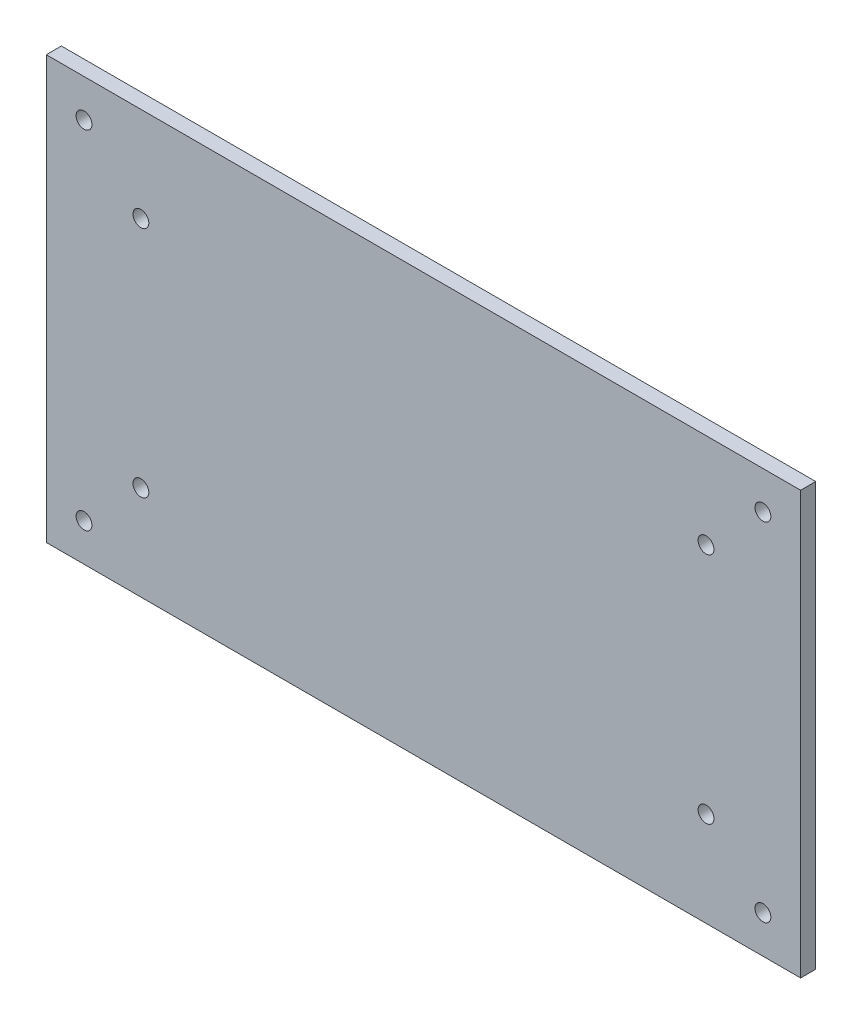
ISO-10303-21;
HEADER;
FILE_DESCRIPTION(('STEP AP214'),'2;1');
FILE_NAME('part.step','',(''),(''),'','','');
FILE_SCHEMA(('AUTOMOTIVE_DESIGN { 1 0 10303 214 1 1 1 1 }'));
ENDSEC;
DATA;
#1=APPLICATION_CONTEXT('core data for automotive mechanical design processes');
#2=APPLICATION_PROTOCOL_DEFINITION('international standard','automotive_design',2000,#1);
#3=PRODUCT_CONTEXT('',#1,'mechanical');
#4=PRODUCT('Part','Part','',(#3));
#5=PRODUCT_RELATED_PRODUCT_CATEGORY('part','',(#4));
#6=PRODUCT_DEFINITION_FORMATION('','',#4);
#7=PRODUCT_DEFINITION_CONTEXT('part definition',#1,'design');
#8=PRODUCT_DEFINITION('design','',#6,#7);
#9=PRODUCT_DEFINITION_SHAPE('','',#8);
#10=(LENGTH_UNIT() NAMED_UNIT(*) SI_UNIT(.MILLI.,.METRE.));
#11=(NAMED_UNIT(*) PLANE_ANGLE_UNIT() SI_UNIT($,.RADIAN.));
#12=(NAMED_UNIT(*) SI_UNIT($,.STERADIAN.) SOLID_ANGLE_UNIT());
#13=UNCERTAINTY_MEASURE_WITH_UNIT(LENGTH_MEASURE(1.E-05),#10,'distance_accuracy_value','');
#14=(GEOMETRIC_REPRESENTATION_CONTEXT(3) GLOBAL_UNCERTAINTY_ASSIGNED_CONTEXT((#13)) GLOBAL_UNIT_ASSIGNED_CONTEXT((#10,
#11,#12)) REPRESENTATION_CONTEXT('',''));
#15=CARTESIAN_POINT('',(0.,0.,0.));
#16=DIRECTION('',(0.,0.,1.));
#17=DIRECTION('',(1.,0.,0.));
#18=AXIS2_PLACEMENT_3D('',#15,#16,#17);
#19=CARTESIAN_POINT('',(-0.40426415404847,116.947419354839,2.));
#20=DIRECTION('',(0.,0.,1.));
#21=DIRECTION('',(1.,0.,0.));
#22=AXIS2_PLACEMENT_3D('',#19,#20,#21);
#23=PLANE('',#22);
#24=CARTESIAN_POINT('',(-87.8642641540484,129.487419354839,2.));
#25=DIRECTION('',(0.,0.,1.));
#26=DIRECTION('',(-1.,0.,0.));
#27=AXIS2_PLACEMENT_3D('',#24,#25,#26);
#28=CIRCLE('',#27,1.04999999999999);
#29=CARTESIAN_POINT('',(-88.9142641540483,129.487419354839,2.));
#30=VERTEX_POINT('',#29);
#31=EDGE_CURVE('E143',#30,#30,#28,.T.);
#32=ORIENTED_EDGE('',*,*,#31,.F.);
#33=EDGE_LOOP('',(#32));
#34=FACE_BOUND('',#33,.T.);
#35=CARTESIAN_POINT('',(-12.9442641540485,129.487419354839,2.));
#36=DIRECTION('',(0.,0.,1.));
#37=DIRECTION('',(1.,0.,0.));
#38=AXIS2_PLACEMENT_3D('',#35,#36,#37);
#39=CIRCLE('',#38,1.05);
#40=CARTESIAN_POINT('',(-11.8942641540485,129.487419354839,2.));
#41=VERTEX_POINT('',#40);
#42=EDGE_CURVE('E131',#41,#41,#39,.T.);
#43=ORIENTED_EDGE('',*,*,#42,.F.);
#44=EDGE_LOOP('',(#43));
#45=FACE_BOUND('',#44,.T.);
#46=CARTESIAN_POINT('',(-95.4042641540487,121.947419354839,2.));
#47=DIRECTION('',(0.,0.,1.));
#48=DIRECTION('',(1.,0.,0.));
#49=AXIS2_PLACEMENT_3D('',#46,#47,#48);
#50=CIRCLE('',#49,1.04999999999996);
#51=CARTESIAN_POINT('',(-94.3542641540487,121.947419354839,2.));
#52=VERTEX_POINT('',#51);
#53=EDGE_CURVE('E119',#52,#52,#50,.T.);
#54=ORIENTED_EDGE('',*,*,#53,.F.);
#55=EDGE_LOOP('',(#54));
#56=FACE_BOUND('',#55,.T.);
#57=CARTESIAN_POINT('',(-5.40426415404838,167.947419354839,2.));
#58=DIRECTION('',(0.,0.,1.));
#59=DIRECTION('',(1.,0.,0.));
#60=AXIS2_PLACEMENT_3D('',#57,#58,#59);
#61=CIRCLE('',#60,1.04999999999975);
#62=CARTESIAN_POINT('',(-4.35426415404863,167.947419354839,2.));
#63=VERTEX_POINT('',#62);
#64=EDGE_CURVE('E98',#63,#63,#61,.T.);
#65=ORIENTED_EDGE('',*,*,#64,.F.);
#66=EDGE_LOOP('',(#65));
#67=FACE_BOUND('',#66,.T.);
#68=DIRECTION('',(0.,1.,0.));
#69=VECTOR('',#68,1.);
#70=CARTESIAN_POINT('',(-0.404264154048468,172.947419354839,2.));
#71=LINE('',#70,#69);
#72=CARTESIAN_POINT('',(-0.404264154048468,116.947419354839,2.));
#73=VERTEX_POINT('',#72);
#74=CARTESIAN_POINT('',(-0.404264154048468,172.947419354839,2.));
#75=VERTEX_POINT('',#74);
#76=EDGE_CURVE('E83',#73,#75,#71,.T.);
#77=ORIENTED_EDGE('',*,*,#76,.T.);
#78=DIRECTION('',(-1.,0.,0.));
#79=VECTOR('',#78,1.);
#80=CARTESIAN_POINT('',(-100.404264154048,172.947419354839,2.));
#81=LINE('',#80,#79);
#82=CARTESIAN_POINT('',(-100.404264154048,172.947419354839,2.));
#83=VERTEX_POINT('',#82);
#84=EDGE_CURVE('E78',#75,#83,#81,.T.);
#85=ORIENTED_EDGE('',*,*,#84,.T.);
#86=DIRECTION('',(0.,-1.,0.));
#87=VECTOR('',#86,1.);
#88=CARTESIAN_POINT('',(-100.404264154048,172.947419354839,2.));
#89=LINE('',#88,#87);
#90=CARTESIAN_POINT('',(-100.404264154048,116.947419354839,2.));
#91=VERTEX_POINT('',#90);
#92=EDGE_CURVE('E81',#83,#91,#89,.T.);
#93=ORIENTED_EDGE('',*,*,#92,.T.);
#94=DIRECTION('',(1.,0.,0.));
#95=VECTOR('',#94,1.);
#96=CARTESIAN_POINT('',(-100.404264154048,116.947419354839,2.));
#97=LINE('',#96,#95);
#98=EDGE_CURVE('E48',#91,#73,#97,.T.);
#99=ORIENTED_EDGE('',*,*,#98,.T.);
#100=EDGE_LOOP('',(#77,#85,#93,#99));
#101=FACE_BOUND('',#100,.T.);
#102=CARTESIAN_POINT('',(-95.4042641540487,167.947419354839,2.));
#103=DIRECTION('',(0.,0.,1.));
#104=DIRECTION('',(-1.,0.,0.));
#105=AXIS2_PLACEMENT_3D('',#102,#103,#104);
#106=CIRCLE('',#105,1.04999999999996);
#107=CARTESIAN_POINT('',(-96.4542641540486,167.947419354839,2.));
#108=VERTEX_POINT('',#107);
#109=EDGE_CURVE('E113',#108,#108,#106,.T.);
#110=ORIENTED_EDGE('',*,*,#109,.F.);
#111=EDGE_LOOP('',(#110));
#112=FACE_BOUND('',#111,.T.);
#113=CARTESIAN_POINT('',(-5.4042641540486,121.947419354839,2.));
#114=DIRECTION('',(0.,0.,1.));
#115=DIRECTION('',(-1.,0.,0.));
#116=AXIS2_PLACEMENT_3D('',#113,#114,#115);
#117=CIRCLE('',#116,1.04999999999996);
#118=CARTESIAN_POINT('',(-6.45426415404856,121.947419354839,2.));
#119=VERTEX_POINT('',#118);
#120=EDGE_CURVE('E125',#119,#119,#117,.T.);
#121=ORIENTED_EDGE('',*,*,#120,.F.);
#122=EDGE_LOOP('',(#121));
#123=FACE_BOUND('',#122,.T.);
#124=CARTESIAN_POINT('',(-12.9442641540485,160.407419354839,2.));
#125=DIRECTION('',(0.,0.,1.));
#126=DIRECTION('',(-1.,0.,0.));
#127=AXIS2_PLACEMENT_3D('',#124,#125,#126);
#128=CIRCLE('',#127,1.05);
#129=CARTESIAN_POINT('',(-13.9942641540485,160.407419354839,2.));
#130=VERTEX_POINT('',#129);
#131=EDGE_CURVE('E137',#130,#130,#128,.T.);
#132=ORIENTED_EDGE('',*,*,#131,.F.);
#133=EDGE_LOOP('',(#132));
#134=FACE_BOUND('',#133,.T.);
#135=CARTESIAN_POINT('',(-87.8642641540485,160.407419354839,2.));
#136=DIRECTION('',(0.,0.,1.));
#137=DIRECTION('',(1.,0.,0.));
#138=AXIS2_PLACEMENT_3D('',#135,#136,#137);
#139=CIRCLE('',#138,1.05);
#140=CARTESIAN_POINT('',(-86.8142641540485,160.407419354839,2.));
#141=VERTEX_POINT('',#140);
#142=EDGE_CURVE('E149',#141,#141,#139,.T.);
#143=ORIENTED_EDGE('',*,*,#142,.F.);
#144=EDGE_LOOP('',(#143));
#145=FACE_BOUND('',#144,.T.);
#146=ADVANCED_FACE('F31',(#34,#45,#56,#67,#101,#112,#123,#134,#145),#23,.T.);
#147=CARTESIAN_POINT('',(-0.40426415404847,116.947419354839,0.));
#148=DIRECTION('',(0.,0.,1.));
#149=DIRECTION('',(1.,0.,0.));
#150=AXIS2_PLACEMENT_3D('',#147,#148,#149);
#151=PLANE('',#150);
#152=CARTESIAN_POINT('',(-87.8642641540484,129.487419354839,0.));
#153=DIRECTION('',(0.,0.,1.));
#154=DIRECTION('',(-1.,0.,0.));
#155=AXIS2_PLACEMENT_3D('',#152,#153,#154);
#156=CIRCLE('',#155,1.04999999999999);
#157=CARTESIAN_POINT('',(-88.9142641540483,129.487419354839,0.));
#158=VERTEX_POINT('',#157);
#159=EDGE_CURVE('E146',#158,#158,#156,.T.);
#160=ORIENTED_EDGE('',*,*,#159,.T.);
#161=EDGE_LOOP('',(#160));
#162=FACE_BOUND('',#161,.T.);
#163=CARTESIAN_POINT('',(-12.9442641540485,129.487419354839,0.));
#164=DIRECTION('',(0.,0.,1.));
#165=DIRECTION('',(1.,0.,0.));
#166=AXIS2_PLACEMENT_3D('',#163,#164,#165);
#167=CIRCLE('',#166,1.05);
#168=CARTESIAN_POINT('',(-11.8942641540485,129.487419354839,0.));
#169=VERTEX_POINT('',#168);
#170=EDGE_CURVE('E134',#169,#169,#167,.T.);
#171=ORIENTED_EDGE('',*,*,#170,.T.);
#172=EDGE_LOOP('',(#171));
#173=FACE_BOUND('',#172,.T.);
#174=CARTESIAN_POINT('',(-95.4042641540487,121.947419354839,0.));
#175=DIRECTION('',(0.,0.,1.));
#176=DIRECTION('',(1.,0.,0.));
#177=AXIS2_PLACEMENT_3D('',#174,#175,#176);
#178=CIRCLE('',#177,1.04999999999996);
#179=CARTESIAN_POINT('',(-94.3542641540487,121.947419354839,0.));
#180=VERTEX_POINT('',#179);
#181=EDGE_CURVE('E122',#180,#180,#178,.T.);
#182=ORIENTED_EDGE('',*,*,#181,.T.);
#183=EDGE_LOOP('',(#182));
#184=FACE_BOUND('',#183,.T.);
#185=CARTESIAN_POINT('',(-5.40426415404838,167.947419354839,0.));
#186=DIRECTION('',(0.,0.,1.));
#187=DIRECTION('',(1.,0.,0.));
#188=AXIS2_PLACEMENT_3D('',#185,#186,#187);
#189=CIRCLE('',#188,1.04999999999975);
#190=CARTESIAN_POINT('',(-4.35426415404863,167.947419354839,0.));
#191=VERTEX_POINT('',#190);
#192=EDGE_CURVE('E110',#191,#191,#189,.T.);
#193=ORIENTED_EDGE('',*,*,#192,.T.);
#194=EDGE_LOOP('',(#193));
#195=FACE_BOUND('',#194,.T.);
#196=DIRECTION('',(0.,1.,0.));
#197=VECTOR('',#196,1.);
#198=CARTESIAN_POINT('',(-0.404264154048468,172.947419354839,0.));
#199=LINE('',#198,#197);
#200=CARTESIAN_POINT('',(-0.404264154048468,116.947419354839,0.));
#201=VERTEX_POINT('',#200);
#202=CARTESIAN_POINT('',(-0.404264154048468,172.947419354839,0.));
#203=VERTEX_POINT('',#202);
#204=EDGE_CURVE('E95',#201,#203,#199,.T.);
#205=ORIENTED_EDGE('',*,*,#204,.F.);
#206=DIRECTION('',(1.,0.,0.));
#207=VECTOR('',#206,1.);
#208=CARTESIAN_POINT('',(-100.404264154048,116.947419354839,0.));
#209=LINE('',#208,#207);
#210=CARTESIAN_POINT('',(-100.404264154048,116.947419354839,0.));
#211=VERTEX_POINT('',#210);
#212=EDGE_CURVE('E71',#211,#201,#209,.T.);
#213=ORIENTED_EDGE('',*,*,#212,.F.);
#214=DIRECTION('',(0.,-1.,0.));
#215=VECTOR('',#214,1.);
#216=CARTESIAN_POINT('',(-100.404264154048,172.947419354839,0.));
#217=LINE('',#216,#215);
#218=CARTESIAN_POINT('',(-100.404264154048,172.947419354839,0.));
#219=VERTEX_POINT('',#218);
#220=EDGE_CURVE('E65',#219,#211,#217,.T.);
#221=ORIENTED_EDGE('',*,*,#220,.F.);
#222=DIRECTION('',(-1.,0.,0.));
#223=VECTOR('',#222,1.);
#224=CARTESIAN_POINT('',(-100.404264154048,172.947419354839,0.));
#225=LINE('',#224,#223);
#226=EDGE_CURVE('E87',#203,#219,#225,.T.);
#227=ORIENTED_EDGE('',*,*,#226,.F.);
#228=EDGE_LOOP('',(#205,#213,#221,#227));
#229=FACE_BOUND('',#228,.T.);
#230=CARTESIAN_POINT('',(-95.4042641540487,167.947419354839,0.));
#231=DIRECTION('',(0.,0.,1.));
#232=DIRECTION('',(-1.,0.,0.));
#233=AXIS2_PLACEMENT_3D('',#230,#231,#232);
#234=CIRCLE('',#233,1.04999999999996);
#235=CARTESIAN_POINT('',(-96.4542641540486,167.947419354839,0.));
#236=VERTEX_POINT('',#235);
#237=EDGE_CURVE('E116',#236,#236,#234,.T.);
#238=ORIENTED_EDGE('',*,*,#237,.T.);
#239=EDGE_LOOP('',(#238));
#240=FACE_BOUND('',#239,.T.);
#241=CARTESIAN_POINT('',(-5.4042641540486,121.947419354839,0.));
#242=DIRECTION('',(0.,0.,1.));
#243=DIRECTION('',(-1.,0.,0.));
#244=AXIS2_PLACEMENT_3D('',#241,#242,#243);
#245=CIRCLE('',#244,1.04999999999996);
#246=CARTESIAN_POINT('',(-6.45426415404856,121.947419354839,0.));
#247=VERTEX_POINT('',#246);
#248=EDGE_CURVE('E128',#247,#247,#245,.T.);
#249=ORIENTED_EDGE('',*,*,#248,.T.);
#250=EDGE_LOOP('',(#249));
#251=FACE_BOUND('',#250,.T.);
#252=CARTESIAN_POINT('',(-12.9442641540485,160.407419354839,0.));
#253=DIRECTION('',(0.,0.,1.));
#254=DIRECTION('',(-1.,0.,0.));
#255=AXIS2_PLACEMENT_3D('',#252,#253,#254);
#256=CIRCLE('',#255,1.05);
#257=CARTESIAN_POINT('',(-13.9942641540485,160.407419354839,0.));
#258=VERTEX_POINT('',#257);
#259=EDGE_CURVE('E140',#258,#258,#256,.T.);
#260=ORIENTED_EDGE('',*,*,#259,.T.);
#261=EDGE_LOOP('',(#260));
#262=FACE_BOUND('',#261,.T.);
#263=CARTESIAN_POINT('',(-87.8642641540485,160.407419354839,0.));
#264=DIRECTION('',(0.,0.,1.));
#265=DIRECTION('',(1.,0.,0.));
#266=AXIS2_PLACEMENT_3D('',#263,#264,#265);
#267=CIRCLE('',#266,1.05);
#268=CARTESIAN_POINT('',(-86.8142641540485,160.407419354839,0.));
#269=VERTEX_POINT('',#268);
#270=EDGE_CURVE('E152',#269,#269,#267,.T.);
#271=ORIENTED_EDGE('',*,*,#270,.T.);
#272=EDGE_LOOP('',(#271));
#273=FACE_BOUND('',#272,.T.);
#274=ADVANCED_FACE('F106',(#162,#173,#184,#195,#229,#240,#251,#262,#273),#151,.F.);
#275=CARTESIAN_POINT('',(-0.404264154048468,172.947419354839,2.));
#276=DIRECTION('',(-1.,0.,0.));
#277=DIRECTION('',(0.,0.,1.));
#278=AXIS2_PLACEMENT_3D('',#275,#276,#277);
#279=PLANE('',#278);
#280=ORIENTED_EDGE('',*,*,#204,.T.);
#281=DIRECTION('',(0.,0.,-1.));
#282=VECTOR('',#281,1.);
#283=CARTESIAN_POINT('',(-0.404264154048468,172.947419354839,2.));
#284=LINE('',#283,#282);
#285=EDGE_CURVE('E11',#75,#203,#284,.T.);
#286=ORIENTED_EDGE('',*,*,#285,.F.);
#287=ORIENTED_EDGE('',*,*,#76,.F.);
#288=DIRECTION('',(0.,0.,-1.));
#289=VECTOR('',#288,1.);
#290=CARTESIAN_POINT('',(-0.404264154048468,116.947419354839,2.));
#291=LINE('',#290,#289);
#292=EDGE_CURVE('E91',#73,#201,#291,.T.);
#293=ORIENTED_EDGE('',*,*,#292,.T.);
#294=EDGE_LOOP('',(#280,#286,#287,#293));
#295=FACE_BOUND('',#294,.T.);
#296=ADVANCED_FACE('F33',(#295),#279,.F.);
#297=CARTESIAN_POINT('',(-100.404264154048,172.947419354839,2.));
#298=DIRECTION('',(0.,-1.,0.));
#299=DIRECTION('',(0.,0.,-1.));
#300=AXIS2_PLACEMENT_3D('',#297,#298,#299);
#301=PLANE('',#300);
#302=ORIENTED_EDGE('',*,*,#226,.T.);
#303=DIRECTION('',(0.,0.,-1.));
#304=VECTOR('',#303,1.);
#305=CARTESIAN_POINT('',(-100.404264154048,172.947419354839,2.));
#306=LINE('',#305,#304);
#307=EDGE_CURVE('E40',#83,#219,#306,.T.);
#308=ORIENTED_EDGE('',*,*,#307,.F.);
#309=ORIENTED_EDGE('',*,*,#84,.F.);
#310=ORIENTED_EDGE('',*,*,#285,.T.);
#311=EDGE_LOOP('',(#302,#308,#309,#310));
#312=FACE_BOUND('',#311,.T.);
#313=ADVANCED_FACE('F86',(#312),#301,.F.);
#314=CARTESIAN_POINT('',(-100.404264154048,172.947419354839,2.));
#315=DIRECTION('',(1.,0.,0.));
#316=DIRECTION('',(0.,0.,-1.));
#317=AXIS2_PLACEMENT_3D('',#314,#315,#316);
#318=PLANE('',#317);
#319=ORIENTED_EDGE('',*,*,#220,.T.);
#320=DIRECTION('',(0.,0.,-1.));
#321=VECTOR('',#320,1.);
#322=CARTESIAN_POINT('',(-100.404264154048,116.947419354839,2.));
#323=LINE('',#322,#321);
#324=EDGE_CURVE('E88',#91,#211,#323,.T.);
#325=ORIENTED_EDGE('',*,*,#324,.F.);
#326=ORIENTED_EDGE('',*,*,#92,.F.);
#327=ORIENTED_EDGE('',*,*,#307,.T.);
#328=EDGE_LOOP('',(#319,#325,#326,#327));
#329=FACE_BOUND('',#328,.T.);
#330=ADVANCED_FACE('F89',(#329),#318,.F.);
#331=CARTESIAN_POINT('',(-100.404264154048,116.947419354839,2.));
#332=DIRECTION('',(0.,1.,0.));
#333=DIRECTION('',(0.,0.,1.));
#334=AXIS2_PLACEMENT_3D('',#331,#332,#333);
#335=PLANE('',#334);
#336=ORIENTED_EDGE('',*,*,#212,.T.);
#337=ORIENTED_EDGE('',*,*,#292,.F.);
#338=ORIENTED_EDGE('',*,*,#98,.F.);
#339=ORIENTED_EDGE('',*,*,#324,.T.);
#340=EDGE_LOOP('',(#336,#337,#338,#339));
#341=FACE_BOUND('',#340,.T.);
#342=ADVANCED_FACE('F103',(#341),#335,.F.);
#343=CARTESIAN_POINT('',(-5.40426415404838,167.947419354839,2.));
#344=DIRECTION('',(0.,0.,-1.));
#345=DIRECTION('',(-1.,0.,0.));
#346=AXIS2_PLACEMENT_3D('',#343,#344,#345);
#347=CYLINDRICAL_SURFACE('',#346,1.04999999999975);
#348=ORIENTED_EDGE('',*,*,#64,.T.);
#349=EDGE_LOOP('',(#348));
#350=FACE_BOUND('',#349,.T.);
#351=ORIENTED_EDGE('',*,*,#192,.F.);
#352=EDGE_LOOP('',(#351));
#353=FACE_BOUND('',#352,.T.);
#354=ADVANCED_FACE('F172',(#350,#353),#347,.F.);
#355=CARTESIAN_POINT('',(-95.4042641540487,167.947419354839,2.));
#356=DIRECTION('',(0.,0.,-1.));
#357=DIRECTION('',(-1.,0.,0.));
#358=AXIS2_PLACEMENT_3D('',#355,#356,#357);
#359=CYLINDRICAL_SURFACE('',#358,1.04999999999996);
#360=ORIENTED_EDGE('',*,*,#109,.T.);
#361=EDGE_LOOP('',(#360));
#362=FACE_BOUND('',#361,.T.);
#363=ORIENTED_EDGE('',*,*,#237,.F.);
#364=EDGE_LOOP('',(#363));
#365=FACE_BOUND('',#364,.T.);
#366=ADVANCED_FACE('F218',(#362,#365),#359,.F.);
#367=CARTESIAN_POINT('',(-95.4042641540487,121.947419354839,2.));
#368=DIRECTION('',(0.,0.,-1.));
#369=DIRECTION('',(-1.,0.,0.));
#370=AXIS2_PLACEMENT_3D('',#367,#368,#369);
#371=CYLINDRICAL_SURFACE('',#370,1.04999999999996);
#372=ORIENTED_EDGE('',*,*,#53,.T.);
#373=EDGE_LOOP('',(#372));
#374=FACE_BOUND('',#373,.T.);
#375=ORIENTED_EDGE('',*,*,#181,.F.);
#376=EDGE_LOOP('',(#375));
#377=FACE_BOUND('',#376,.T.);
#378=ADVANCED_FACE('F226',(#374,#377),#371,.F.);
#379=CARTESIAN_POINT('',(-5.4042641540486,121.947419354839,2.));
#380=DIRECTION('',(0.,0.,-1.));
#381=DIRECTION('',(-1.,0.,0.));
#382=AXIS2_PLACEMENT_3D('',#379,#380,#381);
#383=CYLINDRICAL_SURFACE('',#382,1.04999999999996);
#384=ORIENTED_EDGE('',*,*,#120,.T.);
#385=EDGE_LOOP('',(#384));
#386=FACE_BOUND('',#385,.T.);
#387=ORIENTED_EDGE('',*,*,#248,.F.);
#388=EDGE_LOOP('',(#387));
#389=FACE_BOUND('',#388,.T.);
#390=ADVANCED_FACE('F234',(#386,#389),#383,.F.);
#391=CARTESIAN_POINT('',(-12.9442641540485,129.487419354839,2.));
#392=DIRECTION('',(0.,0.,-1.));
#393=DIRECTION('',(-1.,0.,0.));
#394=AXIS2_PLACEMENT_3D('',#391,#392,#393);
#395=CYLINDRICAL_SURFACE('',#394,1.05);
#396=ORIENTED_EDGE('',*,*,#42,.T.);
#397=EDGE_LOOP('',(#396));
#398=FACE_BOUND('',#397,.T.);
#399=ORIENTED_EDGE('',*,*,#170,.F.);
#400=EDGE_LOOP('',(#399));
#401=FACE_BOUND('',#400,.T.);
#402=ADVANCED_FACE('F243',(#398,#401),#395,.F.);
#403=CARTESIAN_POINT('',(-12.9442641540485,160.407419354839,2.));
#404=DIRECTION('',(0.,0.,-1.));
#405=DIRECTION('',(-1.,0.,0.));
#406=AXIS2_PLACEMENT_3D('',#403,#404,#405);
#407=CYLINDRICAL_SURFACE('',#406,1.05);
#408=ORIENTED_EDGE('',*,*,#131,.T.);
#409=EDGE_LOOP('',(#408));
#410=FACE_BOUND('',#409,.T.);
#411=ORIENTED_EDGE('',*,*,#259,.F.);
#412=EDGE_LOOP('',(#411));
#413=FACE_BOUND('',#412,.T.);
#414=ADVANCED_FACE('F252',(#410,#413),#407,.F.);
#415=CARTESIAN_POINT('',(-87.8642641540484,129.487419354839,2.));
#416=DIRECTION('',(0.,0.,-1.));
#417=DIRECTION('',(-1.,0.,0.));
#418=AXIS2_PLACEMENT_3D('',#415,#416,#417);
#419=CYLINDRICAL_SURFACE('',#418,1.04999999999999);
#420=ORIENTED_EDGE('',*,*,#31,.T.);
#421=EDGE_LOOP('',(#420));
#422=FACE_BOUND('',#421,.T.);
#423=ORIENTED_EDGE('',*,*,#159,.F.);
#424=EDGE_LOOP('',(#423));
#425=FACE_BOUND('',#424,.T.);
#426=ADVANCED_FACE('F261',(#422,#425),#419,.F.);
#427=CARTESIAN_POINT('',(-87.8642641540485,160.407419354839,2.));
#428=DIRECTION('',(0.,0.,-1.));
#429=DIRECTION('',(-1.,0.,0.));
#430=AXIS2_PLACEMENT_3D('',#427,#428,#429);
#431=CYLINDRICAL_SURFACE('',#430,1.05);
#432=ORIENTED_EDGE('',*,*,#142,.T.);
#433=EDGE_LOOP('',(#432));
#434=FACE_BOUND('',#433,.T.);
#435=ORIENTED_EDGE('',*,*,#270,.F.);
#436=EDGE_LOOP('',(#435));
#437=FACE_BOUND('',#436,.T.);
#438=ADVANCED_FACE('F158',(#434,#437),#431,.F.);
#439=CLOSED_SHELL('',(#146,#274,#296,#313,#330,#342,#354,#366,#378,#390,#402,#414,#426,#438));
#440=MANIFOLD_SOLID_BREP('B2',#439);
#441=ADVANCED_BREP_SHAPE_REPRESENTATION('',(#18,#440),#14);
#442=SHAPE_DEFINITION_REPRESENTATION(#9,#441);
ENDSEC;
END-ISO-10303-21;
